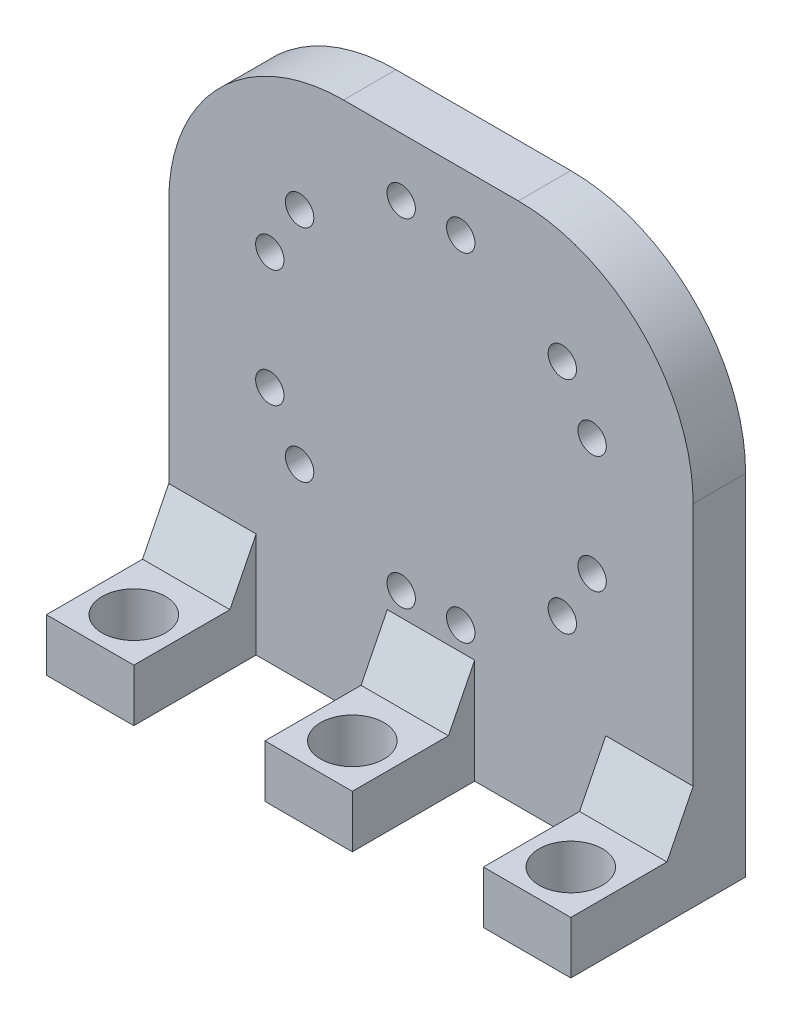
ISO-10303-21;
HEADER;
FILE_DESCRIPTION(('STEP AP214'),'2;1');
FILE_NAME('part.step','',(''),(''),'','','');
FILE_SCHEMA(('AUTOMOTIVE_DESIGN { 1 0 10303 214 1 1 1 1 }'));
ENDSEC;
DATA;
#1=APPLICATION_CONTEXT('core data for automotive mechanical design processes');
#2=APPLICATION_PROTOCOL_DEFINITION('international standard','automotive_design',2000,#1);
#3=PRODUCT_CONTEXT('',#1,'mechanical');
#4=PRODUCT('Part','Part','',(#3));
#5=PRODUCT_RELATED_PRODUCT_CATEGORY('part','',(#4));
#6=PRODUCT_DEFINITION_FORMATION('','',#4);
#7=PRODUCT_DEFINITION_CONTEXT('part definition',#1,'design');
#8=PRODUCT_DEFINITION('design','',#6,#7);
#9=PRODUCT_DEFINITION_SHAPE('','',#8);
#10=(LENGTH_UNIT() NAMED_UNIT(*) SI_UNIT(.MILLI.,.METRE.));
#11=(NAMED_UNIT(*) PLANE_ANGLE_UNIT() SI_UNIT($,.RADIAN.));
#12=(NAMED_UNIT(*) SI_UNIT($,.STERADIAN.) SOLID_ANGLE_UNIT());
#13=UNCERTAINTY_MEASURE_WITH_UNIT(LENGTH_MEASURE(1.E-05),#10,'distance_accuracy_value','');
#14=(GEOMETRIC_REPRESENTATION_CONTEXT(3) GLOBAL_UNCERTAINTY_ASSIGNED_CONTEXT((#13)) GLOBAL_UNIT_ASSIGNED_CONTEXT((#10,
#11,#12)) REPRESENTATION_CONTEXT('',''));
#15=CARTESIAN_POINT('',(0.,0.,0.));
#16=DIRECTION('',(0.,0.,1.));
#17=DIRECTION('',(1.,0.,0.));
#18=AXIS2_PLACEMENT_3D('',#15,#16,#17);
#19=CARTESIAN_POINT('',(0.,0.,6.));
#20=DIRECTION('',(0.,0.,1.));
#21=DIRECTION('',(1.,0.,0.));
#22=AXIS2_PLACEMENT_3D('',#19,#20,#21);
#23=PLANE('',#22);
#24=CARTESIAN_POINT('',(-3.40697724582519,-15.3219281140995,6.));
#25=DIRECTION('',(0.,0.,1.));
#26=DIRECTION('',(1.,0.,0.));
#27=AXIS2_PLACEMENT_3D('',#24,#25,#26);
#28=CIRCLE('',#27,1.625);
#29=CARTESIAN_POINT('',(-1.78197724582519,-15.3219281140995,6.));
#30=VERTEX_POINT('',#29);
#31=EDGE_CURVE('E798',#30,#30,#28,.T.);
#32=ORIENTED_EDGE('',*,*,#31,.F.);
#33=EDGE_LOOP('',(#32));
#34=FACE_BOUND('',#33,.T.);
#35=CARTESIAN_POINT('',(18.4367692198196,-2.71043521204944,6.));
#36=DIRECTION('',(0.,0.,1.));
#37=DIRECTION('',(1.,0.,0.));
#38=AXIS2_PLACEMENT_3D('',#35,#36,#37);
#39=CIRCLE('',#38,1.625);
#40=CARTESIAN_POINT('',(20.0617692198196,-2.71043521204944,6.));
#41=VERTEX_POINT('',#40);
#42=EDGE_CURVE('E795',#41,#41,#39,.T.);
#43=ORIENTED_EDGE('',*,*,#42,.F.);
#44=EDGE_LOOP('',(#43));
#45=FACE_BOUND('',#44,.T.);
#46=CARTESIAN_POINT('',(15.0297919739945,-8.61149290204977,6.));
#47=DIRECTION('',(0.,0.,1.));
#48=DIRECTION('',(1.,0.,0.));
#49=AXIS2_PLACEMENT_3D('',#46,#47,#48);
#50=CIRCLE('',#49,1.625);
#51=CARTESIAN_POINT('',(16.6547919739944,-8.61149290204977,6.));
#52=VERTEX_POINT('',#51);
#53=EDGE_CURVE('E745',#52,#52,#50,.T.);
#54=ORIENTED_EDGE('',*,*,#53,.F.);
#55=EDGE_LOOP('',(#54));
#56=FACE_BOUND('',#55,.T.);
#57=CARTESIAN_POINT('',(15.0297919739942,16.6114929020501,6.));
#58=DIRECTION('',(0.,0.,1.));
#59=DIRECTION('',(1.,0.,0.));
#60=AXIS2_PLACEMENT_3D('',#57,#58,#59);
#61=CIRCLE('',#60,1.625);
#62=CARTESIAN_POINT('',(16.6547919739942,16.6114929020501,6.));
#63=VERTEX_POINT('',#62);
#64=EDGE_CURVE('E791',#63,#63,#61,.T.);
#65=ORIENTED_EDGE('',*,*,#64,.F.);
#66=EDGE_LOOP('',(#65));
#67=FACE_BOUND('',#66,.T.);
#68=CARTESIAN_POINT('',(18.4367692198194,10.7104352120498,6.));
#69=DIRECTION('',(0.,0.,1.));
#70=DIRECTION('',(1.,0.,0.));
#71=AXIS2_PLACEMENT_3D('',#68,#69,#70);
#72=CIRCLE('',#71,1.625);
#73=CARTESIAN_POINT('',(20.0617692198194,10.7104352120498,6.));
#74=VERTEX_POINT('',#73);
#75=EDGE_CURVE('E788',#74,#74,#72,.T.);
#76=ORIENTED_EDGE('',*,*,#75,.F.);
#77=EDGE_LOOP('',(#76));
#78=FACE_BOUND('',#77,.T.);
#79=CARTESIAN_POINT('',(-15.0297919739944,16.6114929020499,6.));
#80=DIRECTION('',(0.,0.,1.));
#81=DIRECTION('',(1.,0.,0.));
#82=AXIS2_PLACEMENT_3D('',#79,#80,#81);
#83=CIRCLE('',#82,1.625);
#84=CARTESIAN_POINT('',(-13.4047919739944,16.6114929020499,6.));
#85=VERTEX_POINT('',#84);
#86=EDGE_CURVE('E785',#85,#85,#83,.T.);
#87=ORIENTED_EDGE('',*,*,#86,.F.);
#88=EDGE_LOOP('',(#87));
#89=FACE_BOUND('',#88,.T.);
#90=CARTESIAN_POINT('',(-15.0297919739943,-8.61149290204997,6.));
#91=DIRECTION('',(0.,0.,1.));
#92=DIRECTION('',(1.,0.,0.));
#93=AXIS2_PLACEMENT_3D('',#90,#91,#92);
#94=CIRCLE('',#93,1.625);
#95=CARTESIAN_POINT('',(-13.4047919739943,-8.61149290204997,6.));
#96=VERTEX_POINT('',#95);
#97=EDGE_CURVE('E782',#96,#96,#94,.T.);
#98=ORIENTED_EDGE('',*,*,#97,.F.);
#99=EDGE_LOOP('',(#98));
#100=FACE_BOUND('',#99,.T.);
#101=CARTESIAN_POINT('',(-18.4367692198195,-2.71043521204968,6.));
#102=DIRECTION('',(0.,0.,1.));
#103=DIRECTION('',(1.,0.,0.));
#104=AXIS2_PLACEMENT_3D('',#101,#102,#103);
#105=CIRCLE('',#104,1.625);
#106=CARTESIAN_POINT('',(-16.8117692198195,-2.71043521204968,6.));
#107=VERTEX_POINT('',#106);
#108=EDGE_CURVE('E779',#107,#107,#105,.T.);
#109=ORIENTED_EDGE('',*,*,#108,.F.);
#110=EDGE_LOOP('',(#109));
#111=FACE_BOUND('',#110,.T.);
#112=CARTESIAN_POINT('',(3.40697724582518,-15.3219281140995,6.));
#113=DIRECTION('',(0.,0.,1.));
#114=DIRECTION('',(1.,0.,0.));
#115=AXIS2_PLACEMENT_3D('',#112,#113,#114);
#116=CIRCLE('',#115,1.625);
#117=CARTESIAN_POINT('',(5.03197724582518,-15.3219281140995,6.));
#118=VERTEX_POINT('',#117);
#119=EDGE_CURVE('E774',#118,#118,#116,.T.);
#120=ORIENTED_EDGE('',*,*,#119,.F.);
#121=EDGE_LOOP('',(#120));
#122=FACE_BOUND('',#121,.T.);
#123=CARTESIAN_POINT('',(-18.4367692198195,10.7104352120496,6.));
#124=DIRECTION('',(0.,0.,1.));
#125=DIRECTION('',(1.,0.,0.));
#126=AXIS2_PLACEMENT_3D('',#123,#124,#125);
#127=CIRCLE('',#126,1.625);
#128=CARTESIAN_POINT('',(-16.8117692198195,10.7104352120496,6.));
#129=VERTEX_POINT('',#128);
#130=EDGE_CURVE('E803',#129,#129,#127,.T.);
#131=ORIENTED_EDGE('',*,*,#130,.F.);
#132=EDGE_LOOP('',(#131));
#133=FACE_BOUND('',#132,.T.);
#134=CARTESIAN_POINT('',(3.40697724582519,23.3219281140995,6.));
#135=DIRECTION('',(0.,0.,1.));
#136=DIRECTION('',(1.,0.,0.));
#137=AXIS2_PLACEMENT_3D('',#134,#135,#136);
#138=CIRCLE('',#137,1.625);
#139=CARTESIAN_POINT('',(5.03197724582519,23.3219281140995,6.));
#140=VERTEX_POINT('',#139);
#141=EDGE_CURVE('E809',#140,#140,#138,.T.);
#142=ORIENTED_EDGE('',*,*,#141,.F.);
#143=EDGE_LOOP('',(#142));
#144=FACE_BOUND('',#143,.T.);
#145=CARTESIAN_POINT('',(-3.40697724582518,23.3219281140995,6.));
#146=DIRECTION('',(0.,0.,1.));
#147=DIRECTION('',(1.,0.,0.));
#148=AXIS2_PLACEMENT_3D('',#145,#146,#147);
#149=CIRCLE('',#148,1.625);
#150=CARTESIAN_POINT('',(-1.78197724582518,23.3219281140995,6.));
#151=VERTEX_POINT('',#150);
#152=EDGE_CURVE('E815',#151,#151,#149,.T.);
#153=ORIENTED_EDGE('',*,*,#152,.F.);
#154=EDGE_LOOP('',(#153));
#155=FACE_BOUND('',#154,.T.);
#156=DIRECTION('',(-1.,0.,0.));
#157=VECTOR('',#156,1.);
#158=CARTESIAN_POINT('',(-30.,30.,6.));
#159=LINE('',#158,#157);
#160=CARTESIAN_POINT('',(9.99999999999999,30.,6.));
#161=VERTEX_POINT('',#160);
#162=CARTESIAN_POINT('',(-10.,30.,6.));
#163=VERTEX_POINT('',#162);
#164=EDGE_CURVE('E298',#161,#163,#159,.T.);
#165=ORIENTED_EDGE('',*,*,#164,.T.);
#166=CARTESIAN_POINT('',(-10.,9.99999999999999,6.));
#167=DIRECTION('',(0.,0.,1.));
#168=DIRECTION('',(1.,0.,0.));
#169=AXIS2_PLACEMENT_3D('',#166,#167,#168);
#170=CIRCLE('',#169,20.);
#171=CARTESIAN_POINT('',(-30.,9.99999999999999,6.));
#172=VERTEX_POINT('',#171);
#173=EDGE_CURVE('E44',#163,#172,#170,.T.);
#174=ORIENTED_EDGE('',*,*,#173,.T.);
#175=DIRECTION('',(0.,-1.,0.));
#176=VECTOR('',#175,1.);
#177=CARTESIAN_POINT('',(-30.,30.,6.));
#178=LINE('',#177,#176);
#179=CARTESIAN_POINT('',(-30.,-18.,6.));
#180=VERTEX_POINT('',#179);
#181=EDGE_CURVE('E191',#172,#180,#178,.T.);
#182=ORIENTED_EDGE('',*,*,#181,.T.);
#183=DIRECTION('',(1.,0.,0.));
#184=VECTOR('',#183,1.);
#185=CARTESIAN_POINT('',(-66.7082039324994,-18.,6.));
#186=LINE('',#185,#184);
#187=CARTESIAN_POINT('',(-20.,-18.,6.));
#188=VERTEX_POINT('',#187);
#189=EDGE_CURVE('E185',#180,#188,#186,.T.);
#190=ORIENTED_EDGE('',*,*,#189,.T.);
#191=DIRECTION('',(0.,-1.,0.));
#192=VECTOR('',#191,1.);
#193=CARTESIAN_POINT('',(-20.,-24.,6.));
#194=LINE('',#193,#192);
#195=CARTESIAN_POINT('',(-20.,-30.,6.));
#196=VERTEX_POINT('',#195);
#197=EDGE_CURVE('E170',#188,#196,#194,.T.);
#198=ORIENTED_EDGE('',*,*,#197,.T.);
#199=DIRECTION('',(1.,0.,0.));
#200=VECTOR('',#199,1.);
#201=CARTESIAN_POINT('',(-30.,-30.,6.));
#202=LINE('',#201,#200);
#203=CARTESIAN_POINT('',(-5.,-30.,6.));
#204=VERTEX_POINT('',#203);
#205=EDGE_CURVE('E294',#196,#204,#202,.T.);
#206=ORIENTED_EDGE('',*,*,#205,.T.);
#207=DIRECTION('',(0.,-1.,0.));
#208=VECTOR('',#207,1.);
#209=CARTESIAN_POINT('',(-5.,-24.,6.));
#210=LINE('',#209,#208);
#211=CARTESIAN_POINT('',(-5.,-18.,6.));
#212=VERTEX_POINT('',#211);
#213=EDGE_CURVE('E228',#212,#204,#210,.T.);
#214=ORIENTED_EDGE('',*,*,#213,.F.);
#215=DIRECTION('',(1.,0.,0.));
#216=VECTOR('',#215,1.);
#217=CARTESIAN_POINT('',(-16.7082039324994,-18.,6.));
#218=LINE('',#217,#216);
#219=CARTESIAN_POINT('',(5.,-18.,6.));
#220=VERTEX_POINT('',#219);
#221=EDGE_CURVE('E201',#212,#220,#218,.T.);
#222=ORIENTED_EDGE('',*,*,#221,.T.);
#223=DIRECTION('',(0.,-1.,0.));
#224=VECTOR('',#223,1.);
#225=CARTESIAN_POINT('',(5.,-24.,6.));
#226=LINE('',#225,#224);
#227=CARTESIAN_POINT('',(5.,-30.,6.));
#228=VERTEX_POINT('',#227);
#229=EDGE_CURVE('E219',#220,#228,#226,.T.);
#230=ORIENTED_EDGE('',*,*,#229,.T.);
#231=CARTESIAN_POINT('',(20.,-30.,6.));
#232=VERTEX_POINT('',#231);
#233=EDGE_CURVE('E292',#228,#232,#202,.T.);
#234=ORIENTED_EDGE('',*,*,#233,.T.);
#235=DIRECTION('',(0.,-1.,0.));
#236=VECTOR('',#235,1.);
#237=CARTESIAN_POINT('',(20.,-24.,6.));
#238=LINE('',#237,#236);
#239=CARTESIAN_POINT('',(20.,-18.,6.));
#240=VERTEX_POINT('',#239);
#241=EDGE_CURVE('E268',#240,#232,#238,.T.);
#242=ORIENTED_EDGE('',*,*,#241,.F.);
#243=DIRECTION('',(1.,0.,0.));
#244=VECTOR('',#243,1.);
#245=CARTESIAN_POINT('',(13.2917960675006,-18.,6.));
#246=LINE('',#245,#244);
#247=CARTESIAN_POINT('',(30.,-18.,6.));
#248=VERTEX_POINT('',#247);
#249=EDGE_CURVE('E260',#240,#248,#246,.T.);
#250=ORIENTED_EDGE('',*,*,#249,.T.);
#251=DIRECTION('',(0.,1.,0.));
#252=VECTOR('',#251,1.);
#253=CARTESIAN_POINT('',(30.,30.,6.));
#254=LINE('',#253,#252);
#255=CARTESIAN_POINT('',(30.,9.99999999999999,6.));
#256=VERTEX_POINT('',#255);
#257=EDGE_CURVE('E296',#248,#256,#254,.T.);
#258=ORIENTED_EDGE('',*,*,#257,.T.);
#259=CARTESIAN_POINT('',(9.99999999999999,9.99999999999999,6.));
#260=DIRECTION('',(0.,0.,1.));
#261=DIRECTION('',(1.,0.,0.));
#262=AXIS2_PLACEMENT_3D('',#259,#260,#261);
#263=CIRCLE('',#262,20.);
#264=EDGE_CURVE('E323',#256,#161,#263,.T.);
#265=ORIENTED_EDGE('',*,*,#264,.T.);
#266=EDGE_LOOP('',(#165,#174,#182,#190,#198,#206,#214,#222,#230,#234,#242,#250,#258,#265));
#267=FACE_BOUND('',#266,.T.);
#268=ADVANCED_FACE('F36',(#34,#45,#56,#67,#78,#89,#100,#111,#122,#133,#144,#155,#267),#23,.T.);
#269=CARTESIAN_POINT('',(-30.,30.,6.));
#270=DIRECTION('',(1.,0.,0.));
#271=DIRECTION('',(0.,1.,0.));
#272=AXIS2_PLACEMENT_3D('',#269,#270,#271);
#273=PLANE('',#272);
#274=ORIENTED_EDGE('',*,*,#181,.F.);
#275=DIRECTION('',(0.,0.,-1.));
#276=VECTOR('',#275,1.);
#277=CARTESIAN_POINT('',(-30.,9.99999999999999,6.));
#278=LINE('',#277,#276);
#279=CARTESIAN_POINT('',(-30.,9.99999999999999,0.));
#280=VERTEX_POINT('',#279);
#281=EDGE_CURVE('E312',#172,#280,#278,.T.);
#282=ORIENTED_EDGE('',*,*,#281,.T.);
#283=DIRECTION('',(0.,-1.,0.));
#284=VECTOR('',#283,1.);
#285=CARTESIAN_POINT('',(-30.,30.,0.));
#286=LINE('',#285,#284);
#287=CARTESIAN_POINT('',(-30.,-30.,0.));
#288=VERTEX_POINT('',#287);
#289=EDGE_CURVE('E285',#280,#288,#286,.T.);
#290=ORIENTED_EDGE('',*,*,#289,.T.);
#291=DIRECTION('',(0.,0.,-1.));
#292=VECTOR('',#291,1.);
#293=CARTESIAN_POINT('',(-30.,-30.,6.));
#294=LINE('',#293,#292);
#295=CARTESIAN_POINT('',(-30.,-30.,20.));
#296=VERTEX_POINT('',#295);
#297=EDGE_CURVE('E309',#296,#288,#294,.T.);
#298=ORIENTED_EDGE('',*,*,#297,.F.);
#299=DIRECTION('',(0.,-1.,0.));
#300=VECTOR('',#299,1.);
#301=CARTESIAN_POINT('',(-30.,-24.,20.));
#302=LINE('',#301,#300);
#303=CARTESIAN_POINT('',(-30.,-24.,20.));
#304=VERTEX_POINT('',#303);
#305=EDGE_CURVE('E212',#304,#296,#302,.T.);
#306=ORIENTED_EDGE('',*,*,#305,.F.);
#307=DIRECTION('',(0.,0.,-1.));
#308=VECTOR('',#307,1.);
#309=CARTESIAN_POINT('',(-30.,-24.,20.));
#310=LINE('',#309,#308);
#311=CARTESIAN_POINT('',(-30.,-24.,9.));
#312=VERTEX_POINT('',#311);
#313=EDGE_CURVE('E220',#304,#312,#310,.T.);
#314=ORIENTED_EDGE('',*,*,#313,.T.);
#315=DIRECTION('',(0.,0.894427190999916,-0.447213595499958));
#316=VECTOR('',#315,1.);
#317=CARTESIAN_POINT('',(-30.,-18.,6.));
#318=LINE('',#317,#316);
#319=EDGE_CURVE('E194',#312,#180,#318,.T.);
#320=ORIENTED_EDGE('',*,*,#319,.T.);
#321=EDGE_LOOP('',(#274,#282,#290,#298,#306,#314,#320));
#322=FACE_BOUND('',#321,.T.);
#323=ADVANCED_FACE('F328',(#322),#273,.F.);
#324=CARTESIAN_POINT('',(-30.,-30.,6.));
#325=DIRECTION('',(0.,1.,0.));
#326=DIRECTION('',(0.,0.,1.));
#327=AXIS2_PLACEMENT_3D('',#324,#325,#326);
#328=PLANE('',#327);
#329=CARTESIAN_POINT('',(-25.,-30.,15.));
#330=DIRECTION('',(0.,1.,0.));
#331=DIRECTION('',(0.,0.,1.));
#332=AXIS2_PLACEMENT_3D('',#329,#330,#331);
#333=CIRCLE('',#332,3.625);
#334=CARTESIAN_POINT('',(-25.,-30.,18.625));
#335=VERTEX_POINT('',#334);
#336=EDGE_CURVE('E821',#335,#335,#333,.T.);
#337=ORIENTED_EDGE('',*,*,#336,.T.);
#338=EDGE_LOOP('',(#337));
#339=FACE_BOUND('',#338,.T.);
#340=CARTESIAN_POINT('',(0.,-30.,15.));
#341=DIRECTION('',(0.,1.,0.));
#342=DIRECTION('',(0.,0.,1.));
#343=AXIS2_PLACEMENT_3D('',#340,#341,#342);
#344=CIRCLE('',#343,3.625);
#345=CARTESIAN_POINT('',(0.,-30.,18.625));
#346=VERTEX_POINT('',#345);
#347=EDGE_CURVE('E188',#346,#346,#344,.T.);
#348=ORIENTED_EDGE('',*,*,#347,.T.);
#349=EDGE_LOOP('',(#348));
#350=FACE_BOUND('',#349,.T.);
#351=CARTESIAN_POINT('',(25.,-30.,15.));
#352=DIRECTION('',(0.,1.,0.));
#353=DIRECTION('',(0.,0.,1.));
#354=AXIS2_PLACEMENT_3D('',#351,#352,#353);
#355=CIRCLE('',#354,3.625);
#356=CARTESIAN_POINT('',(25.,-30.,18.625));
#357=VERTEX_POINT('',#356);
#358=EDGE_CURVE('E254',#357,#357,#355,.T.);
#359=ORIENTED_EDGE('',*,*,#358,.T.);
#360=EDGE_LOOP('',(#359));
#361=FACE_BOUND('',#360,.T.);
#362=DIRECTION('',(1.,0.,0.));
#363=VECTOR('',#362,1.);
#364=CARTESIAN_POINT('',(-30.,-30.,0.));
#365=LINE('',#364,#363);
#366=CARTESIAN_POINT('',(30.,-30.,0.));
#367=VERTEX_POINT('',#366);
#368=EDGE_CURVE('E302',#288,#367,#365,.T.);
#369=ORIENTED_EDGE('',*,*,#368,.T.);
#370=DIRECTION('',(0.,0.,-1.));
#371=VECTOR('',#370,1.);
#372=CARTESIAN_POINT('',(30.,-30.,6.));
#373=LINE('',#372,#371);
#374=CARTESIAN_POINT('',(30.,-30.,20.));
#375=VERTEX_POINT('',#374);
#376=EDGE_CURVE('E300',#375,#367,#373,.T.);
#377=ORIENTED_EDGE('',*,*,#376,.F.);
#378=DIRECTION('',(-1.,0.,0.));
#379=VECTOR('',#378,1.);
#380=CARTESIAN_POINT('',(30.,-30.,20.));
#381=LINE('',#380,#379);
#382=CARTESIAN_POINT('',(20.,-30.,20.));
#383=VERTEX_POINT('',#382);
#384=EDGE_CURVE('E272',#375,#383,#381,.T.);
#385=ORIENTED_EDGE('',*,*,#384,.T.);
#386=DIRECTION('',(0.,0.,-1.));
#387=VECTOR('',#386,1.);
#388=CARTESIAN_POINT('',(20.,-30.,20.));
#389=LINE('',#388,#387);
#390=EDGE_CURVE('E279',#383,#232,#389,.T.);
#391=ORIENTED_EDGE('',*,*,#390,.T.);
#392=ORIENTED_EDGE('',*,*,#233,.F.);
#393=DIRECTION('',(0.,0.,-1.));
#394=VECTOR('',#393,1.);
#395=CARTESIAN_POINT('',(5.,-30.,20.));
#396=LINE('',#395,#394);
#397=CARTESIAN_POINT('',(5.,-30.,20.));
#398=VERTEX_POINT('',#397);
#399=EDGE_CURVE('E235',#398,#228,#396,.T.);
#400=ORIENTED_EDGE('',*,*,#399,.F.);
#401=DIRECTION('',(-1.,0.,0.));
#402=VECTOR('',#401,1.);
#403=CARTESIAN_POINT('',(5.,-30.,20.));
#404=LINE('',#403,#402);
#405=CARTESIAN_POINT('',(-5.,-30.,20.));
#406=VERTEX_POINT('',#405);
#407=EDGE_CURVE('E227',#398,#406,#404,.T.);
#408=ORIENTED_EDGE('',*,*,#407,.T.);
#409=DIRECTION('',(0.,0.,-1.));
#410=VECTOR('',#409,1.);
#411=CARTESIAN_POINT('',(-5.,-30.,20.));
#412=LINE('',#411,#410);
#413=EDGE_CURVE('E247',#406,#204,#412,.T.);
#414=ORIENTED_EDGE('',*,*,#413,.T.);
#415=ORIENTED_EDGE('',*,*,#205,.F.);
#416=DIRECTION('',(0.,0.,-1.));
#417=VECTOR('',#416,1.);
#418=CARTESIAN_POINT('',(-20.,-30.,20.));
#419=LINE('',#418,#417);
#420=CARTESIAN_POINT('',(-20.,-30.,20.));
#421=VERTEX_POINT('',#420);
#422=EDGE_CURVE('E176',#421,#196,#419,.T.);
#423=ORIENTED_EDGE('',*,*,#422,.F.);
#424=DIRECTION('',(-1.,0.,0.));
#425=VECTOR('',#424,1.);
#426=CARTESIAN_POINT('',(-20.,-30.,20.));
#427=LINE('',#426,#425);
#428=EDGE_CURVE('E209',#421,#296,#427,.T.);
#429=ORIENTED_EDGE('',*,*,#428,.T.);
#430=ORIENTED_EDGE('',*,*,#297,.T.);
#431=EDGE_LOOP('',(#369,#377,#385,#391,#392,#400,#408,#414,#415,#423,#429,#430));
#432=FACE_BOUND('',#431,.T.);
#433=ADVANCED_FACE('F344',(#339,#350,#361,#432),#328,.F.);
#434=CARTESIAN_POINT('',(30.,30.,6.));
#435=DIRECTION('',(-1.,0.,0.));
#436=DIRECTION('',(0.,-1.,0.));
#437=AXIS2_PLACEMENT_3D('',#434,#435,#436);
#438=PLANE('',#437);
#439=DIRECTION('',(0.,1.,0.));
#440=VECTOR('',#439,1.);
#441=CARTESIAN_POINT('',(30.,30.,0.));
#442=LINE('',#441,#440);
#443=CARTESIAN_POINT('',(30.,9.99999999999999,0.));
#444=VERTEX_POINT('',#443);
#445=EDGE_CURVE('E304',#367,#444,#442,.T.);
#446=ORIENTED_EDGE('',*,*,#445,.T.);
#447=DIRECTION('',(0.,0.,-1.));
#448=VECTOR('',#447,1.);
#449=CARTESIAN_POINT('',(30.,9.99999999999999,6.));
#450=LINE('',#449,#448);
#451=EDGE_CURVE('E11',#444,#256,#450,.F.);
#452=ORIENTED_EDGE('',*,*,#451,.T.);
#453=ORIENTED_EDGE('',*,*,#257,.F.);
#454=DIRECTION('',(0.,-0.894427190999916,0.447213595499958));
#455=VECTOR('',#454,1.);
#456=CARTESIAN_POINT('',(30.,-18.,6.));
#457=LINE('',#456,#455);
#458=CARTESIAN_POINT('',(30.,-24.,9.));
#459=VERTEX_POINT('',#458);
#460=EDGE_CURVE('E257',#248,#459,#457,.T.);
#461=ORIENTED_EDGE('',*,*,#460,.T.);
#462=DIRECTION('',(0.,0.,-1.));
#463=VECTOR('',#462,1.);
#464=CARTESIAN_POINT('',(30.,-24.,20.));
#465=LINE('',#464,#463);
#466=CARTESIAN_POINT('',(30.,-24.,20.));
#467=VERTEX_POINT('',#466);
#468=EDGE_CURVE('E282',#467,#459,#465,.T.);
#469=ORIENTED_EDGE('',*,*,#468,.F.);
#470=DIRECTION('',(0.,-1.,0.));
#471=VECTOR('',#470,1.);
#472=CARTESIAN_POINT('',(30.,-24.,20.));
#473=LINE('',#472,#471);
#474=EDGE_CURVE('E269',#467,#375,#473,.T.);
#475=ORIENTED_EDGE('',*,*,#474,.T.);
#476=ORIENTED_EDGE('',*,*,#376,.T.);
#477=EDGE_LOOP('',(#446,#452,#453,#461,#469,#475,#476));
#478=FACE_BOUND('',#477,.T.);
#479=ADVANCED_FACE('F340',(#478),#438,.F.);
#480=CARTESIAN_POINT('',(-30.,30.,6.));
#481=DIRECTION('',(0.,-1.,0.));
#482=DIRECTION('',(1.,0.,0.));
#483=AXIS2_PLACEMENT_3D('',#480,#481,#482);
#484=PLANE('',#483);
#485=DIRECTION('',(-1.,0.,0.));
#486=VECTOR('',#485,1.);
#487=CARTESIAN_POINT('',(-30.,30.,0.));
#488=LINE('',#487,#486);
#489=CARTESIAN_POINT('',(9.99999999999999,30.,0.));
#490=VERTEX_POINT('',#489);
#491=CARTESIAN_POINT('',(-10.,30.,0.));
#492=VERTEX_POINT('',#491);
#493=EDGE_CURVE('E293',#490,#492,#488,.T.);
#494=ORIENTED_EDGE('',*,*,#493,.T.);
#495=DIRECTION('',(0.,0.,-1.));
#496=VECTOR('',#495,1.);
#497=CARTESIAN_POINT('',(-10.,30.,6.));
#498=LINE('',#497,#496);
#499=EDGE_CURVE('E57',#492,#163,#498,.F.);
#500=ORIENTED_EDGE('',*,*,#499,.T.);
#501=ORIENTED_EDGE('',*,*,#164,.F.);
#502=DIRECTION('',(0.,0.,-1.));
#503=VECTOR('',#502,1.);
#504=CARTESIAN_POINT('',(9.99999999999999,30.,6.));
#505=LINE('',#504,#503);
#506=EDGE_CURVE('E319',#161,#490,#505,.T.);
#507=ORIENTED_EDGE('',*,*,#506,.T.);
#508=EDGE_LOOP('',(#494,#500,#501,#507));
#509=FACE_BOUND('',#508,.T.);
#510=ADVANCED_FACE('F335',(#509),#484,.F.);
#511=CARTESIAN_POINT('',(0.,0.,0.));
#512=DIRECTION('',(0.,0.,1.));
#513=DIRECTION('',(1.,0.,0.));
#514=AXIS2_PLACEMENT_3D('',#511,#512,#513);
#515=PLANE('',#514);
#516=CARTESIAN_POINT('',(-3.40697724582519,-15.3219281140995,0.));
#517=DIRECTION('',(0.,0.,-1.));
#518=DIRECTION('',(1.,0.,0.));
#519=AXIS2_PLACEMENT_3D('',#516,#517,#518);
#520=CIRCLE('',#519,1.625);
#521=CARTESIAN_POINT('',(-1.78197724582519,-15.3219281140995,0.));
#522=VERTEX_POINT('',#521);
#523=EDGE_CURVE('E754',#522,#522,#520,.T.);
#524=ORIENTED_EDGE('',*,*,#523,.F.);
#525=EDGE_LOOP('',(#524));
#526=FACE_BOUND('',#525,.T.);
#527=CARTESIAN_POINT('',(18.4367692198196,-2.71043521204944,0.));
#528=DIRECTION('',(0.,0.,-1.));
#529=DIRECTION('',(0.499999999999992,0.866025403784443,0.));
#530=AXIS2_PLACEMENT_3D('',#527,#528,#529);
#531=CIRCLE('',#530,1.625);
#532=CARTESIAN_POINT('',(19.2492692198196,-1.30314393089972,0.));
#533=VERTEX_POINT('',#532);
#534=EDGE_CURVE('E750',#533,#533,#531,.T.);
#535=ORIENTED_EDGE('',*,*,#534,.F.);
#536=EDGE_LOOP('',(#535));
#537=FACE_BOUND('',#536,.T.);
#538=CARTESIAN_POINT('',(15.0297919739945,-8.61149290204977,0.));
#539=DIRECTION('',(0.,0.,-1.));
#540=DIRECTION('',(0.499999999999992,0.866025403784443,0.));
#541=AXIS2_PLACEMENT_3D('',#538,#539,#540);
#542=CIRCLE('',#541,1.625);
#543=CARTESIAN_POINT('',(15.8422919739944,-7.20420162090005,0.));
#544=VERTEX_POINT('',#543);
#545=EDGE_CURVE('E748',#544,#544,#542,.T.);
#546=ORIENTED_EDGE('',*,*,#545,.F.);
#547=EDGE_LOOP('',(#546));
#548=FACE_BOUND('',#547,.T.);
#549=CARTESIAN_POINT('',(15.0297919739942,16.6114929020501,0.));
#550=DIRECTION('',(0.,0.,-1.));
#551=DIRECTION('',(-0.50000000000001,0.866025403784433,0.));
#552=AXIS2_PLACEMENT_3D('',#549,#550,#551);
#553=CIRCLE('',#552,1.625);
#554=CARTESIAN_POINT('',(14.2172919739942,18.0187841831998,0.));
#555=VERTEX_POINT('',#554);
#556=EDGE_CURVE('E751',#555,#555,#553,.T.);
#557=ORIENTED_EDGE('',*,*,#556,.F.);
#558=EDGE_LOOP('',(#557));
#559=FACE_BOUND('',#558,.T.);
#560=CARTESIAN_POINT('',(18.4367692198194,10.7104352120498,0.));
#561=DIRECTION('',(0.,0.,-1.));
#562=DIRECTION('',(-0.50000000000001,0.866025403784433,0.));
#563=AXIS2_PLACEMENT_3D('',#560,#561,#562);
#564=CIRCLE('',#563,1.625);
#565=CARTESIAN_POINT('',(17.6242692198194,12.1177264931995,0.));
#566=VERTEX_POINT('',#565);
#567=EDGE_CURVE('E757',#566,#566,#564,.T.);
#568=ORIENTED_EDGE('',*,*,#567,.F.);
#569=EDGE_LOOP('',(#568));
#570=FACE_BOUND('',#569,.T.);
#571=CARTESIAN_POINT('',(-15.0297919739944,16.6114929020499,0.));
#572=DIRECTION('',(0.,0.,-1.));
#573=DIRECTION('',(-0.499999999999998,-0.86602540378444,0.));
#574=AXIS2_PLACEMENT_3D('',#571,#572,#573);
#575=CIRCLE('',#574,1.625);
#576=CARTESIAN_POINT('',(-15.8422919739944,15.2042016209002,0.));
#577=VERTEX_POINT('',#576);
#578=EDGE_CURVE('E771',#577,#577,#575,.T.);
#579=ORIENTED_EDGE('',*,*,#578,.F.);
#580=EDGE_LOOP('',(#579));
#581=FACE_BOUND('',#580,.T.);
#582=CARTESIAN_POINT('',(-15.0297919739943,-8.61149290204997,0.));
#583=DIRECTION('',(0.,0.,-1.));
#584=DIRECTION('',(0.500000000000004,-0.866025403784436,0.));
#585=AXIS2_PLACEMENT_3D('',#582,#583,#584);
#586=CIRCLE('',#585,1.625);
#587=CARTESIAN_POINT('',(-14.2172919739943,-10.0187841831997,0.));
#588=VERTEX_POINT('',#587);
#589=EDGE_CURVE('E768',#588,#588,#586,.T.);
#590=ORIENTED_EDGE('',*,*,#589,.F.);
#591=EDGE_LOOP('',(#590));
#592=FACE_BOUND('',#591,.T.);
#593=CARTESIAN_POINT('',(-18.4367692198195,-2.71043521204968,0.));
#594=DIRECTION('',(0.,0.,-1.));
#595=DIRECTION('',(0.500000000000004,-0.866025403784436,0.));
#596=AXIS2_PLACEMENT_3D('',#593,#594,#595);
#597=CIRCLE('',#596,1.625);
#598=CARTESIAN_POINT('',(-17.6242692198195,-4.11772649319939,0.));
#599=VERTEX_POINT('',#598);
#600=EDGE_CURVE('E765',#599,#599,#597,.T.);
#601=ORIENTED_EDGE('',*,*,#600,.F.);
#602=EDGE_LOOP('',(#601));
#603=FACE_BOUND('',#602,.T.);
#604=CARTESIAN_POINT('',(3.40697724582518,-15.3219281140995,0.));
#605=DIRECTION('',(0.,0.,-1.));
#606=DIRECTION('',(1.,0.,0.));
#607=AXIS2_PLACEMENT_3D('',#604,#605,#606);
#608=CIRCLE('',#607,1.625);
#609=CARTESIAN_POINT('',(5.03197724582518,-15.3219281140995,0.));
#610=VERTEX_POINT('',#609);
#611=EDGE_CURVE('E763',#610,#610,#608,.T.);
#612=ORIENTED_EDGE('',*,*,#611,.F.);
#613=EDGE_LOOP('',(#612));
#614=FACE_BOUND('',#613,.T.);
#615=CARTESIAN_POINT('',(-18.4367692198195,10.7104352120496,0.));
#616=DIRECTION('',(0.,0.,-1.));
#617=DIRECTION('',(-0.499999999999998,-0.86602540378444,0.));
#618=AXIS2_PLACEMENT_3D('',#615,#616,#617);
#619=CIRCLE('',#618,1.625);
#620=CARTESIAN_POINT('',(-19.2492692198195,9.30314393089986,0.));
#621=VERTEX_POINT('',#620);
#622=EDGE_CURVE('E800',#621,#621,#619,.T.);
#623=ORIENTED_EDGE('',*,*,#622,.F.);
#624=EDGE_LOOP('',(#623));
#625=FACE_BOUND('',#624,.T.);
#626=CARTESIAN_POINT('',(3.40697724582519,23.3219281140995,0.));
#627=DIRECTION('',(0.,0.,-1.));
#628=DIRECTION('',(-1.,0.,0.));
#629=AXIS2_PLACEMENT_3D('',#626,#627,#628);
#630=CIRCLE('',#629,1.625);
#631=CARTESIAN_POINT('',(1.78197724582519,23.3219281140995,0.));
#632=VERTEX_POINT('',#631);
#633=EDGE_CURVE('E806',#632,#632,#630,.T.);
#634=ORIENTED_EDGE('',*,*,#633,.F.);
#635=EDGE_LOOP('',(#634));
#636=FACE_BOUND('',#635,.T.);
#637=CARTESIAN_POINT('',(-3.40697724582518,23.3219281140995,0.));
#638=DIRECTION('',(0.,0.,-1.));
#639=DIRECTION('',(-1.,0.,0.));
#640=AXIS2_PLACEMENT_3D('',#637,#638,#639);
#641=CIRCLE('',#640,1.625);
#642=CARTESIAN_POINT('',(-5.03197724582518,23.3219281140995,0.));
#643=VERTEX_POINT('',#642);
#644=EDGE_CURVE('E812',#643,#643,#641,.T.);
#645=ORIENTED_EDGE('',*,*,#644,.F.);
#646=EDGE_LOOP('',(#645));
#647=FACE_BOUND('',#646,.T.);
#648=ORIENTED_EDGE('',*,*,#289,.F.);
#649=CARTESIAN_POINT('',(-10.,9.99999999999999,0.));
#650=DIRECTION('',(0.,0.,1.));
#651=DIRECTION('',(1.,0.,0.));
#652=AXIS2_PLACEMENT_3D('',#649,#650,#651);
#653=CIRCLE('',#652,20.);
#654=EDGE_CURVE('E317',#280,#492,#653,.F.);
#655=ORIENTED_EDGE('',*,*,#654,.T.);
#656=ORIENTED_EDGE('',*,*,#493,.F.);
#657=CARTESIAN_POINT('',(9.99999999999999,9.99999999999999,0.));
#658=DIRECTION('',(0.,0.,1.));
#659=DIRECTION('',(1.,0.,0.));
#660=AXIS2_PLACEMENT_3D('',#657,#658,#659);
#661=CIRCLE('',#660,20.);
#662=EDGE_CURVE('E315',#490,#444,#661,.F.);
#663=ORIENTED_EDGE('',*,*,#662,.T.);
#664=ORIENTED_EDGE('',*,*,#445,.F.);
#665=ORIENTED_EDGE('',*,*,#368,.F.);
#666=EDGE_LOOP('',(#648,#655,#656,#663,#664,#665));
#667=FACE_BOUND('',#666,.T.);
#668=ADVANCED_FACE('F333',(#526,#537,#548,#559,#570,#581,#592,#603,#614,#625,#636,#647,#667),
#515,.F.);
#669=CARTESIAN_POINT('',(30.,-24.,20.));
#670=DIRECTION('',(0.,-1.,0.));
#671=DIRECTION('',(0.,0.,-1.));
#672=AXIS2_PLACEMENT_3D('',#669,#670,#671);
#673=PLANE('',#672);
#674=CARTESIAN_POINT('',(25.,-24.,15.));
#675=DIRECTION('',(0.,1.,0.));
#676=DIRECTION('',(0.,0.,1.));
#677=AXIS2_PLACEMENT_3D('',#674,#675,#676);
#678=CIRCLE('',#677,3.625);
#679=CARTESIAN_POINT('',(25.,-24.,18.625));
#680=VERTEX_POINT('',#679);
#681=EDGE_CURVE('E243',#680,#680,#678,.T.);
#682=ORIENTED_EDGE('',*,*,#681,.F.);
#683=EDGE_LOOP('',(#682));
#684=FACE_BOUND('',#683,.T.);
#685=ORIENTED_EDGE('',*,*,#468,.T.);
#686=DIRECTION('',(1.,0.,0.));
#687=VECTOR('',#686,1.);
#688=CARTESIAN_POINT('',(13.2917960675006,-24.,9.));
#689=LINE('',#688,#687);
#690=CARTESIAN_POINT('',(20.,-24.,9.));
#691=VERTEX_POINT('',#690);
#692=EDGE_CURVE('E261',#691,#459,#689,.T.);
#693=ORIENTED_EDGE('',*,*,#692,.F.);
#694=DIRECTION('',(0.,0.,-1.));
#695=VECTOR('',#694,1.);
#696=CARTESIAN_POINT('',(20.,-24.,20.));
#697=LINE('',#696,#695);
#698=CARTESIAN_POINT('',(20.,-24.,20.));
#699=VERTEX_POINT('',#698);
#700=EDGE_CURVE('E286',#699,#691,#697,.T.);
#701=ORIENTED_EDGE('',*,*,#700,.F.);
#702=DIRECTION('',(-1.,0.,0.));
#703=VECTOR('',#702,1.);
#704=CARTESIAN_POINT('',(30.,-24.,20.));
#705=LINE('',#704,#703);
#706=EDGE_CURVE('E277',#467,#699,#705,.T.);
#707=ORIENTED_EDGE('',*,*,#706,.F.);
#708=EDGE_LOOP('',(#685,#693,#701,#707));
#709=FACE_BOUND('',#708,.T.);
#710=ADVANCED_FACE('F398',(#684,#709),#673,.F.);
#711=CARTESIAN_POINT('',(20.,-24.,20.));
#712=DIRECTION('',(1.,0.,0.));
#713=DIRECTION('',(0.,0.,-1.));
#714=AXIS2_PLACEMENT_3D('',#711,#712,#713);
#715=PLANE('',#714);
#716=ORIENTED_EDGE('',*,*,#241,.T.);
#717=ORIENTED_EDGE('',*,*,#390,.F.);
#718=DIRECTION('',(0.,-1.,0.));
#719=VECTOR('',#718,1.);
#720=CARTESIAN_POINT('',(20.,-24.,20.));
#721=LINE('',#720,#719);
#722=EDGE_CURVE('E275',#699,#383,#721,.T.);
#723=ORIENTED_EDGE('',*,*,#722,.F.);
#724=ORIENTED_EDGE('',*,*,#700,.T.);
#725=DIRECTION('',(0.,0.894427190999916,-0.447213595499958));
#726=VECTOR('',#725,1.);
#727=CARTESIAN_POINT('',(20.,-18.,6.));
#728=LINE('',#727,#726);
#729=EDGE_CURVE('E263',#691,#240,#728,.T.);
#730=ORIENTED_EDGE('',*,*,#729,.T.);
#731=EDGE_LOOP('',(#716,#717,#723,#724,#730));
#732=FACE_BOUND('',#731,.T.);
#733=ADVANCED_FACE('F352',(#732),#715,.F.);
#734=CARTESIAN_POINT('',(0.,0.,20.));
#735=DIRECTION('',(0.,0.,-1.));
#736=DIRECTION('',(-1.,0.,0.));
#737=AXIS2_PLACEMENT_3D('',#734,#735,#736);
#738=PLANE('',#737);
#739=ORIENTED_EDGE('',*,*,#474,.F.);
#740=ORIENTED_EDGE('',*,*,#706,.T.);
#741=ORIENTED_EDGE('',*,*,#722,.T.);
#742=ORIENTED_EDGE('',*,*,#384,.F.);
#743=EDGE_LOOP('',(#739,#740,#741,#742));
#744=FACE_BOUND('',#743,.T.);
#745=ADVANCED_FACE('F346',(#744),#738,.F.);
#746=CARTESIAN_POINT('',(13.2917960675006,-18.,6.));
#747=DIRECTION('',(0.,0.447213595499958,0.894427190999916));
#748=DIRECTION('',(0.,-0.894427190999916,0.447213595499958));
#749=AXIS2_PLACEMENT_3D('',#746,#747,#748);
#750=PLANE('',#749);
#751=ORIENTED_EDGE('',*,*,#729,.F.);
#752=ORIENTED_EDGE('',*,*,#692,.T.);
#753=ORIENTED_EDGE('',*,*,#460,.F.);
#754=ORIENTED_EDGE('',*,*,#249,.F.);
#755=EDGE_LOOP('',(#751,#752,#753,#754));
#756=FACE_BOUND('',#755,.T.);
#757=ADVANCED_FACE('F630',(#756),#750,.T.);
#758=CARTESIAN_POINT('',(25.,-39.,15.));
#759=DIRECTION('',(0.,1.,0.));
#760=DIRECTION('',(0.,0.,1.));
#761=AXIS2_PLACEMENT_3D('',#758,#759,#760);
#762=CYLINDRICAL_SURFACE('',#761,3.625);
#763=ORIENTED_EDGE('',*,*,#681,.T.);
#764=EDGE_LOOP('',(#763));
#765=FACE_BOUND('',#764,.T.);
#766=ORIENTED_EDGE('',*,*,#358,.F.);
#767=EDGE_LOOP('',(#766));
#768=FACE_BOUND('',#767,.T.);
#769=ADVANCED_FACE('F380',(#765,#768),#762,.F.);
#770=CARTESIAN_POINT('',(5.,-24.,20.));
#771=DIRECTION('',(1.,0.,0.));
#772=DIRECTION('',(0.,0.,-1.));
#773=AXIS2_PLACEMENT_3D('',#770,#771,#772);
#774=PLANE('',#773);
#775=ORIENTED_EDGE('',*,*,#229,.F.);
#776=DIRECTION('',(0.,-0.894427190999916,0.447213595499958));
#777=VECTOR('',#776,1.);
#778=CARTESIAN_POINT('',(5.,-18.,6.));
#779=LINE('',#778,#777);
#780=CARTESIAN_POINT('',(5.,-24.,9.));
#781=VERTEX_POINT('',#780);
#782=EDGE_CURVE('E198',#220,#781,#779,.T.);
#783=ORIENTED_EDGE('',*,*,#782,.T.);
#784=DIRECTION('',(0.,0.,-1.));
#785=VECTOR('',#784,1.);
#786=CARTESIAN_POINT('',(5.,-24.,20.));
#787=LINE('',#786,#785);
#788=CARTESIAN_POINT('',(5.,-24.,20.));
#789=VERTEX_POINT('',#788);
#790=EDGE_CURVE('E240',#789,#781,#787,.T.);
#791=ORIENTED_EDGE('',*,*,#790,.F.);
#792=DIRECTION('',(0.,-1.,0.));
#793=VECTOR('',#792,1.);
#794=CARTESIAN_POINT('',(5.,-24.,20.));
#795=LINE('',#794,#793);
#796=EDGE_CURVE('E224',#789,#398,#795,.T.);
#797=ORIENTED_EDGE('',*,*,#796,.T.);
#798=ORIENTED_EDGE('',*,*,#399,.T.);
#799=EDGE_LOOP('',(#775,#783,#791,#797,#798));
#800=FACE_BOUND('',#799,.T.);
#801=ADVANCED_FACE('F357',(#800),#774,.T.);
#802=CARTESIAN_POINT('',(5.,-24.,20.));
#803=DIRECTION('',(0.,-1.,0.));
#804=DIRECTION('',(0.,0.,-1.));
#805=AXIS2_PLACEMENT_3D('',#802,#803,#804);
#806=PLANE('',#805);
#807=CARTESIAN_POINT('',(0.,-24.,15.));
#808=DIRECTION('',(0.,1.,0.));
#809=DIRECTION('',(0.,0.,1.));
#810=AXIS2_PLACEMENT_3D('',#807,#808,#809);
#811=CIRCLE('',#810,3.625);
#812=CARTESIAN_POINT('',(0.,-24.,18.625));
#813=VERTEX_POINT('',#812);
#814=EDGE_CURVE('E824',#813,#813,#811,.T.);
#815=ORIENTED_EDGE('',*,*,#814,.F.);
#816=EDGE_LOOP('',(#815));
#817=FACE_BOUND('',#816,.T.);
#818=ORIENTED_EDGE('',*,*,#790,.T.);
#819=DIRECTION('',(1.,0.,0.));
#820=VECTOR('',#819,1.);
#821=CARTESIAN_POINT('',(-16.7082039324994,-24.,9.));
#822=LINE('',#821,#820);
#823=CARTESIAN_POINT('',(-5.,-24.,9.));
#824=VERTEX_POINT('',#823);
#825=EDGE_CURVE('E202',#824,#781,#822,.T.);
#826=ORIENTED_EDGE('',*,*,#825,.F.);
#827=DIRECTION('',(0.,0.,-1.));
#828=VECTOR('',#827,1.);
#829=CARTESIAN_POINT('',(-5.,-24.,20.));
#830=LINE('',#829,#828);
#831=CARTESIAN_POINT('',(-5.,-24.,20.));
#832=VERTEX_POINT('',#831);
#833=EDGE_CURVE('E244',#832,#824,#830,.T.);
#834=ORIENTED_EDGE('',*,*,#833,.F.);
#835=DIRECTION('',(-1.,0.,0.));
#836=VECTOR('',#835,1.);
#837=CARTESIAN_POINT('',(5.,-24.,20.));
#838=LINE('',#837,#836);
#839=EDGE_CURVE('E233',#789,#832,#838,.T.);
#840=ORIENTED_EDGE('',*,*,#839,.F.);
#841=EDGE_LOOP('',(#818,#826,#834,#840));
#842=FACE_BOUND('',#841,.T.);
#843=ADVANCED_FACE('F371',(#817,#842),#806,.F.);
#844=CARTESIAN_POINT('',(-5.,-24.,20.));
#845=DIRECTION('',(1.,0.,0.));
#846=DIRECTION('',(0.,0.,-1.));
#847=AXIS2_PLACEMENT_3D('',#844,#845,#846);
#848=PLANE('',#847);
#849=ORIENTED_EDGE('',*,*,#213,.T.);
#850=ORIENTED_EDGE('',*,*,#413,.F.);
#851=DIRECTION('',(0.,-1.,0.));
#852=VECTOR('',#851,1.);
#853=CARTESIAN_POINT('',(-5.,-24.,20.));
#854=LINE('',#853,#852);
#855=EDGE_CURVE('E231',#832,#406,#854,.T.);
#856=ORIENTED_EDGE('',*,*,#855,.F.);
#857=ORIENTED_EDGE('',*,*,#833,.T.);
#858=DIRECTION('',(0.,0.894427190999916,-0.447213595499958));
#859=VECTOR('',#858,1.);
#860=CARTESIAN_POINT('',(-5.,-18.,6.));
#861=LINE('',#860,#859);
#862=EDGE_CURVE('E180',#824,#212,#861,.T.);
#863=ORIENTED_EDGE('',*,*,#862,.T.);
#864=EDGE_LOOP('',(#849,#850,#856,#857,#863));
#865=FACE_BOUND('',#864,.T.);
#866=ADVANCED_FACE('F366',(#865),#848,.F.);
#867=CARTESIAN_POINT('',(-25.,0.,20.));
#868=DIRECTION('',(0.,0.,-1.));
#869=DIRECTION('',(-1.,0.,0.));
#870=AXIS2_PLACEMENT_3D('',#867,#868,#869);
#871=PLANE('',#870);
#872=ORIENTED_EDGE('',*,*,#796,.F.);
#873=ORIENTED_EDGE('',*,*,#839,.T.);
#874=ORIENTED_EDGE('',*,*,#855,.T.);
#875=ORIENTED_EDGE('',*,*,#407,.F.);
#876=EDGE_LOOP('',(#872,#873,#874,#875));
#877=FACE_BOUND('',#876,.T.);
#878=ADVANCED_FACE('F361',(#877),#871,.F.);
#879=CARTESIAN_POINT('',(-20.,-24.,20.));
#880=DIRECTION('',(1.,0.,0.));
#881=DIRECTION('',(0.,0.,-1.));
#882=AXIS2_PLACEMENT_3D('',#879,#880,#881);
#883=PLANE('',#882);
#884=ORIENTED_EDGE('',*,*,#197,.F.);
#885=DIRECTION('',(0.,-0.894427190999916,0.447213595499958));
#886=VECTOR('',#885,1.);
#887=CARTESIAN_POINT('',(-20.,-18.,6.));
#888=LINE('',#887,#886);
#889=CARTESIAN_POINT('',(-20.,-24.,9.));
#890=VERTEX_POINT('',#889);
#891=EDGE_CURVE('E173',#188,#890,#888,.T.);
#892=ORIENTED_EDGE('',*,*,#891,.T.);
#893=DIRECTION('',(0.,0.,-1.));
#894=VECTOR('',#893,1.);
#895=CARTESIAN_POINT('',(-20.,-24.,20.));
#896=LINE('',#895,#894);
#897=CARTESIAN_POINT('',(-20.,-24.,20.));
#898=VERTEX_POINT('',#897);
#899=EDGE_CURVE('E217',#898,#890,#896,.T.);
#900=ORIENTED_EDGE('',*,*,#899,.F.);
#901=DIRECTION('',(0.,-1.,0.));
#902=VECTOR('',#901,1.);
#903=CARTESIAN_POINT('',(-20.,-24.,20.));
#904=LINE('',#903,#902);
#905=EDGE_CURVE('E179',#898,#421,#904,.T.);
#906=ORIENTED_EDGE('',*,*,#905,.T.);
#907=ORIENTED_EDGE('',*,*,#422,.T.);
#908=EDGE_LOOP('',(#884,#892,#900,#906,#907));
#909=FACE_BOUND('',#908,.T.);
#910=ADVANCED_FACE('F172',(#909),#883,.T.);
#911=CARTESIAN_POINT('',(-20.,-24.,20.));
#912=DIRECTION('',(0.,-1.,0.));
#913=DIRECTION('',(0.,0.,-1.));
#914=AXIS2_PLACEMENT_3D('',#911,#912,#913);
#915=PLANE('',#914);
#916=CARTESIAN_POINT('',(-25.,-24.,15.));
#917=DIRECTION('',(0.,1.,0.));
#918=DIRECTION('',(0.,0.,1.));
#919=AXIS2_PLACEMENT_3D('',#916,#917,#918);
#920=CIRCLE('',#919,3.625);
#921=CARTESIAN_POINT('',(-25.,-24.,18.625));
#922=VERTEX_POINT('',#921);
#923=EDGE_CURVE('E818',#922,#922,#920,.T.);
#924=ORIENTED_EDGE('',*,*,#923,.F.);
#925=EDGE_LOOP('',(#924));
#926=FACE_BOUND('',#925,.T.);
#927=ORIENTED_EDGE('',*,*,#899,.T.);
#928=DIRECTION('',(1.,0.,0.));
#929=VECTOR('',#928,1.);
#930=CARTESIAN_POINT('',(-66.7082039324994,-24.,9.));
#931=LINE('',#930,#929);
#932=EDGE_CURVE('E187',#312,#890,#931,.T.);
#933=ORIENTED_EDGE('',*,*,#932,.F.);
#934=ORIENTED_EDGE('',*,*,#313,.F.);
#935=DIRECTION('',(-1.,0.,0.));
#936=VECTOR('',#935,1.);
#937=CARTESIAN_POINT('',(-20.,-24.,20.));
#938=LINE('',#937,#936);
#939=EDGE_CURVE('E215',#898,#304,#938,.T.);
#940=ORIENTED_EDGE('',*,*,#939,.F.);
#941=EDGE_LOOP('',(#927,#933,#934,#940));
#942=FACE_BOUND('',#941,.T.);
#943=ADVANCED_FACE('F470',(#926,#942),#915,.F.);
#944=CARTESIAN_POINT('',(-50.,0.,20.));
#945=DIRECTION('',(0.,0.,-1.));
#946=DIRECTION('',(-1.,0.,0.));
#947=AXIS2_PLACEMENT_3D('',#944,#945,#946);
#948=PLANE('',#947);
#949=ORIENTED_EDGE('',*,*,#905,.F.);
#950=ORIENTED_EDGE('',*,*,#939,.T.);
#951=ORIENTED_EDGE('',*,*,#305,.T.);
#952=ORIENTED_EDGE('',*,*,#428,.F.);
#953=EDGE_LOOP('',(#949,#950,#951,#952));
#954=FACE_BOUND('',#953,.T.);
#955=ADVANCED_FACE('F467',(#954),#948,.F.);
#956=CARTESIAN_POINT('',(-16.7082039324994,-18.,6.));
#957=DIRECTION('',(0.,0.447213595499958,0.894427190999916));
#958=DIRECTION('',(0.,-0.894427190999916,0.447213595499958));
#959=AXIS2_PLACEMENT_3D('',#956,#957,#958);
#960=PLANE('',#959);
#961=ORIENTED_EDGE('',*,*,#862,.F.);
#962=ORIENTED_EDGE('',*,*,#825,.T.);
#963=ORIENTED_EDGE('',*,*,#782,.F.);
#964=ORIENTED_EDGE('',*,*,#221,.F.);
#965=EDGE_LOOP('',(#961,#962,#963,#964));
#966=FACE_BOUND('',#965,.T.);
#967=ADVANCED_FACE('F369',(#966),#960,.T.);
#968=CARTESIAN_POINT('',(-66.7082039324994,-18.,6.));
#969=DIRECTION('',(0.,0.447213595499958,0.894427190999916));
#970=DIRECTION('',(0.,-0.894427190999916,0.447213595499958));
#971=AXIS2_PLACEMENT_3D('',#968,#969,#970);
#972=PLANE('',#971);
#973=ORIENTED_EDGE('',*,*,#319,.F.);
#974=ORIENTED_EDGE('',*,*,#932,.T.);
#975=ORIENTED_EDGE('',*,*,#891,.F.);
#976=ORIENTED_EDGE('',*,*,#189,.F.);
#977=EDGE_LOOP('',(#973,#974,#975,#976));
#978=FACE_BOUND('',#977,.T.);
#979=ADVANCED_FACE('F184',(#978),#972,.T.);
#980=CARTESIAN_POINT('',(0.,-39.,15.));
#981=DIRECTION('',(0.,1.,0.));
#982=DIRECTION('',(0.,0.,1.));
#983=AXIS2_PLACEMENT_3D('',#980,#981,#982);
#984=CYLINDRICAL_SURFACE('',#983,3.625);
#985=ORIENTED_EDGE('',*,*,#814,.T.);
#986=EDGE_LOOP('',(#985));
#987=FACE_BOUND('',#986,.T.);
#988=ORIENTED_EDGE('',*,*,#347,.F.);
#989=EDGE_LOOP('',(#988));
#990=FACE_BOUND('',#989,.T.);
#991=ADVANCED_FACE('F458',(#987,#990),#984,.F.);
#992=CARTESIAN_POINT('',(-25.,-39.,15.));
#993=DIRECTION('',(0.,1.,0.));
#994=DIRECTION('',(0.,0.,1.));
#995=AXIS2_PLACEMENT_3D('',#992,#993,#994);
#996=CYLINDRICAL_SURFACE('',#995,3.625);
#997=ORIENTED_EDGE('',*,*,#923,.T.);
#998=EDGE_LOOP('',(#997));
#999=FACE_BOUND('',#998,.T.);
#1000=ORIENTED_EDGE('',*,*,#336,.F.);
#1001=EDGE_LOOP('',(#1000));
#1002=FACE_BOUND('',#1001,.T.);
#1003=ADVANCED_FACE('F454',(#999,#1002),#996,.F.);
#1004=CARTESIAN_POINT('',(-3.40697724582518,23.3219281140995,15.));
#1005=DIRECTION('',(0.,0.,-1.));
#1006=DIRECTION('',(-1.,0.,0.));
#1007=AXIS2_PLACEMENT_3D('',#1004,#1005,#1006);
#1008=CYLINDRICAL_SURFACE('',#1007,1.625);
#1009=ORIENTED_EDGE('',*,*,#152,.T.);
#1010=EDGE_LOOP('',(#1009));
#1011=FACE_BOUND('',#1010,.T.);
#1012=ORIENTED_EDGE('',*,*,#644,.T.);
#1013=EDGE_LOOP('',(#1012));
#1014=FACE_BOUND('',#1013,.T.);
#1015=ADVANCED_FACE('F450',(#1011,#1014),#1008,.F.);
#1016=CARTESIAN_POINT('',(3.40697724582519,23.3219281140995,15.));
#1017=DIRECTION('',(0.,0.,-1.));
#1018=DIRECTION('',(-1.,0.,0.));
#1019=AXIS2_PLACEMENT_3D('',#1016,#1017,#1018);
#1020=CYLINDRICAL_SURFACE('',#1019,1.625);
#1021=ORIENTED_EDGE('',*,*,#141,.T.);
#1022=EDGE_LOOP('',(#1021));
#1023=FACE_BOUND('',#1022,.T.);
#1024=ORIENTED_EDGE('',*,*,#633,.T.);
#1025=EDGE_LOOP('',(#1024));
#1026=FACE_BOUND('',#1025,.T.);
#1027=ADVANCED_FACE('F446',(#1023,#1026),#1020,.F.);
#1028=CARTESIAN_POINT('',(-18.4367692198195,10.7104352120496,15.));
#1029=DIRECTION('',(0.,0.,-1.));
#1030=DIRECTION('',(-1.,0.,0.));
#1031=AXIS2_PLACEMENT_3D('',#1028,#1029,#1030);
#1032=CYLINDRICAL_SURFACE('',#1031,1.625);
#1033=ORIENTED_EDGE('',*,*,#130,.T.);
#1034=EDGE_LOOP('',(#1033));
#1035=FACE_BOUND('',#1034,.T.);
#1036=ORIENTED_EDGE('',*,*,#622,.T.);
#1037=EDGE_LOOP('',(#1036));
#1038=FACE_BOUND('',#1037,.T.);
#1039=ADVANCED_FACE('F435',(#1035,#1038),#1032,.F.);
#1040=CARTESIAN_POINT('',(3.40697724582518,-15.3219281140995,15.));
#1041=DIRECTION('',(0.,0.,-1.));
#1042=DIRECTION('',(-1.,0.,0.));
#1043=AXIS2_PLACEMENT_3D('',#1040,#1041,#1042);
#1044=CYLINDRICAL_SURFACE('',#1043,1.625);
#1045=ORIENTED_EDGE('',*,*,#119,.T.);
#1046=EDGE_LOOP('',(#1045));
#1047=FACE_BOUND('',#1046,.T.);
#1048=ORIENTED_EDGE('',*,*,#611,.T.);
#1049=EDGE_LOOP('',(#1048));
#1050=FACE_BOUND('',#1049,.T.);
#1051=ADVANCED_FACE('F431',(#1047,#1050),#1044,.F.);
#1052=CARTESIAN_POINT('',(-18.4367692198195,-2.71043521204968,15.));
#1053=DIRECTION('',(0.,0.,-1.));
#1054=DIRECTION('',(-1.,0.,0.));
#1055=AXIS2_PLACEMENT_3D('',#1052,#1053,#1054);
#1056=CYLINDRICAL_SURFACE('',#1055,1.625);
#1057=ORIENTED_EDGE('',*,*,#108,.T.);
#1058=EDGE_LOOP('',(#1057));
#1059=FACE_BOUND('',#1058,.T.);
#1060=ORIENTED_EDGE('',*,*,#600,.T.);
#1061=EDGE_LOOP('',(#1060));
#1062=FACE_BOUND('',#1061,.T.);
#1063=ADVANCED_FACE('F427',(#1059,#1062),#1056,.F.);
#1064=CARTESIAN_POINT('',(-15.0297919739943,-8.61149290204997,15.));
#1065=DIRECTION('',(0.,0.,-1.));
#1066=DIRECTION('',(-1.,0.,0.));
#1067=AXIS2_PLACEMENT_3D('',#1064,#1065,#1066);
#1068=CYLINDRICAL_SURFACE('',#1067,1.625);
#1069=ORIENTED_EDGE('',*,*,#97,.T.);
#1070=EDGE_LOOP('',(#1069));
#1071=FACE_BOUND('',#1070,.T.);
#1072=ORIENTED_EDGE('',*,*,#589,.T.);
#1073=EDGE_LOOP('',(#1072));
#1074=FACE_BOUND('',#1073,.T.);
#1075=ADVANCED_FACE('F430',(#1071,#1074),#1068,.F.);
#1076=CARTESIAN_POINT('',(-15.0297919739944,16.6114929020499,15.));
#1077=DIRECTION('',(0.,0.,-1.));
#1078=DIRECTION('',(-1.,0.,0.));
#1079=AXIS2_PLACEMENT_3D('',#1076,#1077,#1078);
#1080=CYLINDRICAL_SURFACE('',#1079,1.625);
#1081=ORIENTED_EDGE('',*,*,#86,.T.);
#1082=EDGE_LOOP('',(#1081));
#1083=FACE_BOUND('',#1082,.T.);
#1084=ORIENTED_EDGE('',*,*,#578,.T.);
#1085=EDGE_LOOP('',(#1084));
#1086=FACE_BOUND('',#1085,.T.);
#1087=ADVANCED_FACE('F437',(#1083,#1086),#1080,.F.);
#1088=CARTESIAN_POINT('',(18.4367692198194,10.7104352120498,15.));
#1089=DIRECTION('',(0.,0.,-1.));
#1090=DIRECTION('',(-1.,0.,0.));
#1091=AXIS2_PLACEMENT_3D('',#1088,#1089,#1090);
#1092=CYLINDRICAL_SURFACE('',#1091,1.625);
#1093=ORIENTED_EDGE('',*,*,#75,.T.);
#1094=EDGE_LOOP('',(#1093));
#1095=FACE_BOUND('',#1094,.T.);
#1096=ORIENTED_EDGE('',*,*,#567,.T.);
#1097=EDGE_LOOP('',(#1096));
#1098=FACE_BOUND('',#1097,.T.);
#1099=ADVANCED_FACE('F424',(#1095,#1098),#1092,.F.);
#1100=CARTESIAN_POINT('',(15.0297919739942,16.6114929020501,15.));
#1101=DIRECTION('',(0.,0.,-1.));
#1102=DIRECTION('',(-1.,0.,0.));
#1103=AXIS2_PLACEMENT_3D('',#1100,#1101,#1102);
#1104=CYLINDRICAL_SURFACE('',#1103,1.625);
#1105=ORIENTED_EDGE('',*,*,#64,.T.);
#1106=EDGE_LOOP('',(#1105));
#1107=FACE_BOUND('',#1106,.T.);
#1108=ORIENTED_EDGE('',*,*,#556,.T.);
#1109=EDGE_LOOP('',(#1108));
#1110=FACE_BOUND('',#1109,.T.);
#1111=ADVANCED_FACE('F543',(#1107,#1110),#1104,.F.);
#1112=CARTESIAN_POINT('',(15.0297919739945,-8.61149290204977,15.));
#1113=DIRECTION('',(0.,0.,-1.));
#1114=DIRECTION('',(-1.,0.,0.));
#1115=AXIS2_PLACEMENT_3D('',#1112,#1113,#1114);
#1116=CYLINDRICAL_SURFACE('',#1115,1.625);
#1117=ORIENTED_EDGE('',*,*,#53,.T.);
#1118=EDGE_LOOP('',(#1117));
#1119=FACE_BOUND('',#1118,.T.);
#1120=ORIENTED_EDGE('',*,*,#545,.T.);
#1121=EDGE_LOOP('',(#1120));
#1122=FACE_BOUND('',#1121,.T.);
#1123=ADVANCED_FACE('F418',(#1119,#1122),#1116,.F.);
#1124=CARTESIAN_POINT('',(18.4367692198196,-2.71043521204944,15.));
#1125=DIRECTION('',(0.,0.,-1.));
#1126=DIRECTION('',(-1.,0.,0.));
#1127=AXIS2_PLACEMENT_3D('',#1124,#1125,#1126);
#1128=CYLINDRICAL_SURFACE('',#1127,1.625);
#1129=ORIENTED_EDGE('',*,*,#42,.T.);
#1130=EDGE_LOOP('',(#1129));
#1131=FACE_BOUND('',#1130,.T.);
#1132=ORIENTED_EDGE('',*,*,#534,.T.);
#1133=EDGE_LOOP('',(#1132));
#1134=FACE_BOUND('',#1133,.T.);
#1135=ADVANCED_FACE('F412',(#1131,#1134),#1128,.F.);
#1136=CARTESIAN_POINT('',(-3.40697724582519,-15.3219281140995,15.));
#1137=DIRECTION('',(0.,0.,-1.));
#1138=DIRECTION('',(-1.,0.,0.));
#1139=AXIS2_PLACEMENT_3D('',#1136,#1137,#1138);
#1140=CYLINDRICAL_SURFACE('',#1139,1.625);
#1141=ORIENTED_EDGE('',*,*,#31,.T.);
#1142=EDGE_LOOP('',(#1141));
#1143=FACE_BOUND('',#1142,.T.);
#1144=ORIENTED_EDGE('',*,*,#523,.T.);
#1145=EDGE_LOOP('',(#1144));
#1146=FACE_BOUND('',#1145,.T.);
#1147=ADVANCED_FACE('F407',(#1143,#1146),#1140,.F.);
#1148=CARTESIAN_POINT('',(-10.,9.99999999999999,6.));
#1149=DIRECTION('',(0.,0.,-1.));
#1150=DIRECTION('',(-1.,0.,0.));
#1151=AXIS2_PLACEMENT_3D('',#1148,#1149,#1150);
#1152=CYLINDRICAL_SURFACE('',#1151,20.);
#1153=ORIENTED_EDGE('',*,*,#173,.F.);
#1154=ORIENTED_EDGE('',*,*,#499,.F.);
#1155=ORIENTED_EDGE('',*,*,#654,.F.);
#1156=ORIENTED_EDGE('',*,*,#281,.F.);
#1157=EDGE_LOOP('',(#1153,#1154,#1155,#1156));
#1158=FACE_BOUND('',#1157,.T.);
#1159=ADVANCED_FACE('F330',(#1158),#1152,.T.);
#1160=CARTESIAN_POINT('',(9.99999999999999,9.99999999999999,6.));
#1161=DIRECTION('',(0.,0.,-1.));
#1162=DIRECTION('',(-1.,0.,0.));
#1163=AXIS2_PLACEMENT_3D('',#1160,#1161,#1162);
#1164=CYLINDRICAL_SURFACE('',#1163,20.);
#1165=ORIENTED_EDGE('',*,*,#264,.F.);
#1166=ORIENTED_EDGE('',*,*,#451,.F.);
#1167=ORIENTED_EDGE('',*,*,#662,.F.);
#1168=ORIENTED_EDGE('',*,*,#506,.F.);
#1169=EDGE_LOOP('',(#1165,#1166,#1167,#1168));
#1170=FACE_BOUND('',#1169,.T.);
#1171=ADVANCED_FACE('F38',(#1170),#1164,.T.);
#1172=CLOSED_SHELL('',(#268,#323,#433,#479,#510,#668,#710,#733,#745,#757,#769,#801,#843,#866,
#878,#910,#943,#955,#967,#979,#991,#1003,#1015,#1027,#1039,#1051,#1063,#1075,#1087,#1099,#1111,
#1123,#1135,#1147,#1159,#1171));
#1173=MANIFOLD_SOLID_BREP('B2',#1172);
#1174=ADVANCED_BREP_SHAPE_REPRESENTATION('',(#18,#1173),#14);
#1175=SHAPE_DEFINITION_REPRESENTATION(#9,#1174);
ENDSEC;
END-ISO-10303-21;
